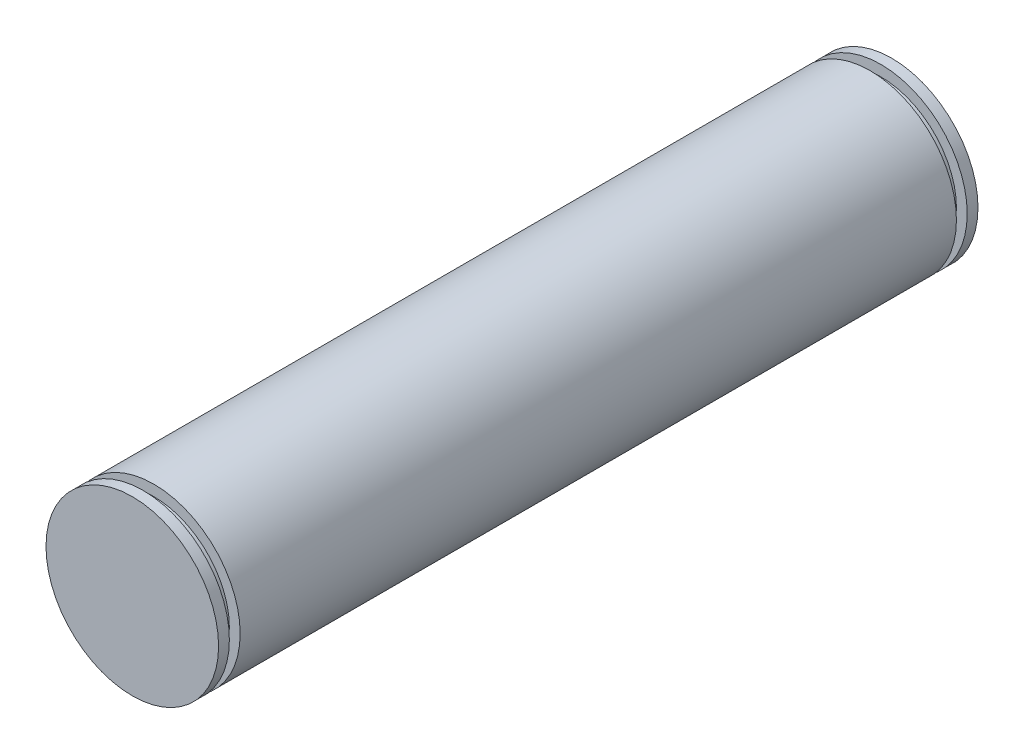
ISO-10303-21;
HEADER;
FILE_DESCRIPTION(('STEP AP214'),'2;1');
FILE_NAME('part.step','',(''),(''),'','','');
FILE_SCHEMA(('AUTOMOTIVE_DESIGN { 1 0 10303 214 1 1 1 1 }'));
ENDSEC;
DATA;
#1=APPLICATION_CONTEXT('core data for automotive mechanical design processes');
#2=APPLICATION_PROTOCOL_DEFINITION('international standard','automotive_design',2000,#1);
#3=PRODUCT_CONTEXT('',#1,'mechanical');
#4=PRODUCT('Part','Part','',(#3));
#5=PRODUCT_RELATED_PRODUCT_CATEGORY('part','',(#4));
#6=PRODUCT_DEFINITION_FORMATION('','',#4);
#7=PRODUCT_DEFINITION_CONTEXT('part definition',#1,'design');
#8=PRODUCT_DEFINITION('design','',#6,#7);
#9=PRODUCT_DEFINITION_SHAPE('','',#8);
#10=(LENGTH_UNIT() NAMED_UNIT(*) SI_UNIT(.MILLI.,.METRE.));
#11=(NAMED_UNIT(*) PLANE_ANGLE_UNIT() SI_UNIT($,.RADIAN.));
#12=(NAMED_UNIT(*) SI_UNIT($,.STERADIAN.) SOLID_ANGLE_UNIT());
#13=UNCERTAINTY_MEASURE_WITH_UNIT(LENGTH_MEASURE(1.E-05),#10,'distance_accuracy_value','');
#14=(GEOMETRIC_REPRESENTATION_CONTEXT(3) GLOBAL_UNCERTAINTY_ASSIGNED_CONTEXT((#13)) GLOBAL_UNIT_ASSIGNED_CONTEXT((#10,
#11,#12)) REPRESENTATION_CONTEXT('',''));
#15=CARTESIAN_POINT('',(0.,0.,0.));
#16=DIRECTION('',(0.,0.,1.));
#17=DIRECTION('',(1.,0.,0.));
#18=AXIS2_PLACEMENT_3D('',#15,#16,#17);
#19=CARTESIAN_POINT('',(0.,0.,-111.76));
#20=DIRECTION('',(0.,0.,-1.));
#21=DIRECTION('',(-1.,0.,0.));
#22=AXIS2_PLACEMENT_3D('',#19,#20,#21);
#23=PLANE('',#22);
#24=CARTESIAN_POINT('',(0.,0.,-111.76));
#25=DIRECTION('',(0.,0.,1.));
#26=DIRECTION('',(1.,0.,0.));
#27=AXIS2_PLACEMENT_3D('',#24,#25,#26);
#28=CIRCLE('',#27,12.7);
#29=CARTESIAN_POINT('',(12.7,0.,-111.76));
#30=VERTEX_POINT('',#29);
#31=EDGE_CURVE('E10',#30,#30,#28,.T.);
#32=ORIENTED_EDGE('',*,*,#31,.F.);
#33=EDGE_LOOP('',(#32));
#34=FACE_BOUND('',#33,.T.);
#35=ADVANCED_FACE('F31',(#34),#23,.T.);
#36=CARTESIAN_POINT('',(0.,0.,0.));
#37=DIRECTION('',(0.,0.,1.));
#38=DIRECTION('',(1.,0.,0.));
#39=AXIS2_PLACEMENT_3D('',#36,#37,#38);
#40=CYLINDRICAL_SURFACE('',#39,12.7);
#41=ORIENTED_EDGE('',*,*,#31,.T.);
#42=EDGE_LOOP('',(#41));
#43=FACE_BOUND('',#42,.T.);
#44=CARTESIAN_POINT('',(0.,0.,-110.1725));
#45=DIRECTION('',(0.,0.,1.));
#46=DIRECTION('',(1.,0.,0.));
#47=AXIS2_PLACEMENT_3D('',#44,#45,#46);
#48=CIRCLE('',#47,12.7);
#49=CARTESIAN_POINT('',(12.7,0.,-110.1725));
#50=VERTEX_POINT('',#49);
#51=EDGE_CURVE('E37',#50,#50,#48,.T.);
#52=ORIENTED_EDGE('',*,*,#51,.F.);
#53=EDGE_LOOP('',(#52));
#54=FACE_BOUND('',#53,.T.);
#55=ADVANCED_FACE('F85',(#43,#54),#40,.T.);
#56=CARTESIAN_POINT('',(12.7,0.,-110.1725));
#57=DIRECTION('',(0.,0.,1.));
#58=DIRECTION('',(1.,0.,0.));
#59=AXIS2_PLACEMENT_3D('',#56,#57,#58);
#60=PLANE('',#59);
#61=ORIENTED_EDGE('',*,*,#51,.T.);
#62=EDGE_LOOP('',(#61));
#63=FACE_BOUND('',#62,.T.);
#64=CARTESIAN_POINT('',(0.,0.,-110.1725));
#65=DIRECTION('',(0.,0.,1.));
#66=DIRECTION('',(1.,0.,0.));
#67=AXIS2_PLACEMENT_3D('',#64,#65,#66);
#68=CIRCLE('',#67,11.1125);
#69=CARTESIAN_POINT('',(11.1125,0.,-110.1725));
#70=VERTEX_POINT('',#69);
#71=EDGE_CURVE('E41',#70,#70,#68,.T.);
#72=ORIENTED_EDGE('',*,*,#71,.F.);
#73=EDGE_LOOP('',(#72));
#74=FACE_BOUND('',#73,.T.);
#75=ADVANCED_FACE('F90',(#63,#74),#60,.T.);
#76=CARTESIAN_POINT('',(0.,0.,0.));
#77=DIRECTION('',(0.,0.,1.));
#78=DIRECTION('',(1.,0.,0.));
#79=AXIS2_PLACEMENT_3D('',#76,#77,#78);
#80=CYLINDRICAL_SURFACE('',#79,11.1125);
#81=ORIENTED_EDGE('',*,*,#71,.T.);
#82=EDGE_LOOP('',(#81));
#83=FACE_BOUND('',#82,.T.);
#84=CARTESIAN_POINT('',(0.,0.,-108.585));
#85=DIRECTION('',(0.,0.,1.));
#86=DIRECTION('',(1.,0.,0.));
#87=AXIS2_PLACEMENT_3D('',#84,#85,#86);
#88=CIRCLE('',#87,11.1125);
#89=CARTESIAN_POINT('',(11.1125,0.,-108.585));
#90=VERTEX_POINT('',#89);
#91=EDGE_CURVE('E45',#90,#90,#88,.T.);
#92=ORIENTED_EDGE('',*,*,#91,.F.);
#93=EDGE_LOOP('',(#92));
#94=FACE_BOUND('',#93,.T.);
#95=ADVANCED_FACE('F94',(#83,#94),#80,.T.);
#96=CARTESIAN_POINT('',(11.1125,0.,-108.585));
#97=DIRECTION('',(0.,0.,-1.));
#98=DIRECTION('',(-1.,0.,0.));
#99=AXIS2_PLACEMENT_3D('',#96,#97,#98);
#100=PLANE('',#99);
#101=ORIENTED_EDGE('',*,*,#91,.T.);
#102=EDGE_LOOP('',(#101));
#103=FACE_BOUND('',#102,.T.);
#104=CARTESIAN_POINT('',(0.,0.,-108.585));
#105=DIRECTION('',(0.,0.,1.));
#106=DIRECTION('',(1.,0.,0.));
#107=AXIS2_PLACEMENT_3D('',#104,#105,#106);
#108=CIRCLE('',#107,12.7);
#109=CARTESIAN_POINT('',(12.7,0.,-108.585));
#110=VERTEX_POINT('',#109);
#111=EDGE_CURVE('E50',#110,#110,#108,.T.);
#112=ORIENTED_EDGE('',*,*,#111,.F.);
#113=EDGE_LOOP('',(#112));
#114=FACE_BOUND('',#113,.T.);
#115=ADVANCED_FACE('F100',(#103,#114),#100,.T.);
#116=CARTESIAN_POINT('',(0.,0.,0.));
#117=DIRECTION('',(0.,0.,1.));
#118=DIRECTION('',(1.,0.,0.));
#119=AXIS2_PLACEMENT_3D('',#116,#117,#118);
#120=CYLINDRICAL_SURFACE('',#119,12.7);
#121=ORIENTED_EDGE('',*,*,#111,.T.);
#122=EDGE_LOOP('',(#121));
#123=FACE_BOUND('',#122,.T.);
#124=CARTESIAN_POINT('',(0.,0.,-3.175));
#125=DIRECTION('',(0.,0.,1.));
#126=DIRECTION('',(1.,0.,0.));
#127=AXIS2_PLACEMENT_3D('',#124,#125,#126);
#128=CIRCLE('',#127,12.7);
#129=CARTESIAN_POINT('',(12.7,0.,-3.175));
#130=VERTEX_POINT('',#129);
#131=EDGE_CURVE('E53',#130,#130,#128,.T.);
#132=ORIENTED_EDGE('',*,*,#131,.F.);
#133=EDGE_LOOP('',(#132));
#134=FACE_BOUND('',#133,.T.);
#135=ADVANCED_FACE('F104',(#123,#134),#120,.T.);
#136=CARTESIAN_POINT('',(11.1125,0.,-3.175));
#137=DIRECTION('',(0.,0.,1.));
#138=DIRECTION('',(1.,0.,0.));
#139=AXIS2_PLACEMENT_3D('',#136,#137,#138);
#140=PLANE('',#139);
#141=ORIENTED_EDGE('',*,*,#131,.T.);
#142=EDGE_LOOP('',(#141));
#143=FACE_BOUND('',#142,.T.);
#144=CARTESIAN_POINT('',(0.,0.,-3.175));
#145=DIRECTION('',(0.,0.,1.));
#146=DIRECTION('',(1.,0.,0.));
#147=AXIS2_PLACEMENT_3D('',#144,#145,#146);
#148=CIRCLE('',#147,11.1125);
#149=CARTESIAN_POINT('',(11.1125,0.,-3.175));
#150=VERTEX_POINT('',#149);
#151=EDGE_CURVE('E56',#150,#150,#148,.T.);
#152=ORIENTED_EDGE('',*,*,#151,.F.);
#153=EDGE_LOOP('',(#152));
#154=FACE_BOUND('',#153,.T.);
#155=ADVANCED_FACE('F108',(#143,#154),#140,.T.);
#156=CARTESIAN_POINT('',(0.,0.,0.));
#157=DIRECTION('',(0.,0.,1.));
#158=DIRECTION('',(1.,0.,0.));
#159=AXIS2_PLACEMENT_3D('',#156,#157,#158);
#160=CYLINDRICAL_SURFACE('',#159,11.1125);
#161=ORIENTED_EDGE('',*,*,#151,.T.);
#162=EDGE_LOOP('',(#161));
#163=FACE_BOUND('',#162,.T.);
#164=CARTESIAN_POINT('',(0.,0.,-1.5875));
#165=DIRECTION('',(0.,0.,1.));
#166=DIRECTION('',(1.,0.,0.));
#167=AXIS2_PLACEMENT_3D('',#164,#165,#166);
#168=CIRCLE('',#167,11.1125);
#169=CARTESIAN_POINT('',(11.1125,0.,-1.5875));
#170=VERTEX_POINT('',#169);
#171=EDGE_CURVE('E59',#170,#170,#168,.T.);
#172=ORIENTED_EDGE('',*,*,#171,.F.);
#173=EDGE_LOOP('',(#172));
#174=FACE_BOUND('',#173,.T.);
#175=ADVANCED_FACE('F81',(#163,#174),#160,.T.);
#176=CARTESIAN_POINT('',(12.7,0.,-1.5875));
#177=DIRECTION('',(0.,0.,-1.));
#178=DIRECTION('',(-1.,0.,0.));
#179=AXIS2_PLACEMENT_3D('',#176,#177,#178);
#180=PLANE('',#179);
#181=ORIENTED_EDGE('',*,*,#171,.T.);
#182=EDGE_LOOP('',(#181));
#183=FACE_BOUND('',#182,.T.);
#184=CARTESIAN_POINT('',(0.,0.,-1.5875));
#185=DIRECTION('',(0.,0.,1.));
#186=DIRECTION('',(1.,0.,0.));
#187=AXIS2_PLACEMENT_3D('',#184,#185,#186);
#188=CIRCLE('',#187,12.7);
#189=CARTESIAN_POINT('',(12.7,0.,-1.5875));
#190=VERTEX_POINT('',#189);
#191=EDGE_CURVE('E62',#190,#190,#188,.T.);
#192=ORIENTED_EDGE('',*,*,#191,.F.);
#193=EDGE_LOOP('',(#192));
#194=FACE_BOUND('',#193,.T.);
#195=ADVANCED_FACE('F73',(#183,#194),#180,.T.);
#196=CARTESIAN_POINT('',(0.,0.,0.));
#197=DIRECTION('',(0.,0.,1.));
#198=DIRECTION('',(1.,0.,0.));
#199=AXIS2_PLACEMENT_3D('',#196,#197,#198);
#200=CYLINDRICAL_SURFACE('',#199,12.7);
#201=ORIENTED_EDGE('',*,*,#191,.T.);
#202=EDGE_LOOP('',(#201));
#203=FACE_BOUND('',#202,.T.);
#204=CARTESIAN_POINT('',(0.,0.,0.));
#205=DIRECTION('',(0.,0.,1.));
#206=DIRECTION('',(1.,0.,0.));
#207=AXIS2_PLACEMENT_3D('',#204,#205,#206);
#208=CIRCLE('',#207,12.7);
#209=CARTESIAN_POINT('',(12.7,0.,0.));
#210=VERTEX_POINT('',#209);
#211=EDGE_CURVE('E65',#210,#210,#208,.T.);
#212=ORIENTED_EDGE('',*,*,#211,.F.);
#213=EDGE_LOOP('',(#212));
#214=FACE_BOUND('',#213,.T.);
#215=ADVANCED_FACE('F71',(#203,#214),#200,.T.);
#216=CARTESIAN_POINT('',(0.,0.,0.));
#217=DIRECTION('',(0.,0.,1.));
#218=DIRECTION('',(1.,0.,0.));
#219=AXIS2_PLACEMENT_3D('',#216,#217,#218);
#220=PLANE('',#219);
#221=ORIENTED_EDGE('',*,*,#211,.T.);
#222=EDGE_LOOP('',(#221));
#223=FACE_BOUND('',#222,.T.);
#224=ADVANCED_FACE('F69',(#223),#220,.T.);
#225=CLOSED_SHELL('',(#35,#55,#75,#95,#115,#135,#155,#175,#195,#215,#224));
#226=MANIFOLD_SOLID_BREP('B2',#225);
#227=ADVANCED_BREP_SHAPE_REPRESENTATION('',(#18,#226),#14);
#228=SHAPE_DEFINITION_REPRESENTATION(#9,#227);
ENDSEC;
END-ISO-10303-21;
